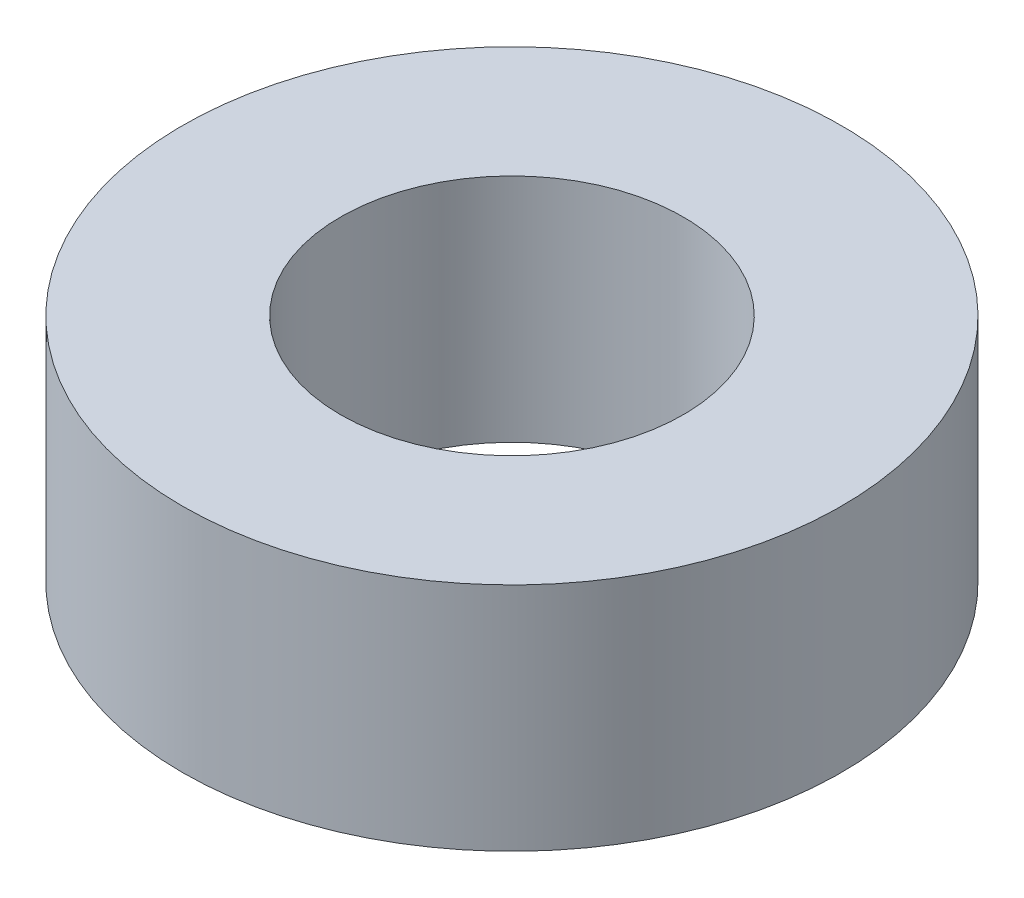
ISO-10303-21;
HEADER;
FILE_DESCRIPTION(('STEP AP214'),'2;1');
FILE_NAME('part.step','',(''),(''),'','','');
FILE_SCHEMA(('AUTOMOTIVE_DESIGN { 1 0 10303 214 1 1 1 1 }'));
ENDSEC;
DATA;
#1=APPLICATION_CONTEXT('core data for automotive mechanical design processes');
#2=APPLICATION_PROTOCOL_DEFINITION('international standard','automotive_design',2000,#1);
#3=PRODUCT_CONTEXT('',#1,'mechanical');
#4=PRODUCT('Part','Part','',(#3));
#5=PRODUCT_RELATED_PRODUCT_CATEGORY('part','',(#4));
#6=PRODUCT_DEFINITION_FORMATION('','',#4);
#7=PRODUCT_DEFINITION_CONTEXT('part definition',#1,'design');
#8=PRODUCT_DEFINITION('design','',#6,#7);
#9=PRODUCT_DEFINITION_SHAPE('','',#8);
#10=(LENGTH_UNIT() NAMED_UNIT(*) SI_UNIT(.MILLI.,.METRE.));
#11=(NAMED_UNIT(*) PLANE_ANGLE_UNIT() SI_UNIT($,.RADIAN.));
#12=(NAMED_UNIT(*) SI_UNIT($,.STERADIAN.) SOLID_ANGLE_UNIT());
#13=UNCERTAINTY_MEASURE_WITH_UNIT(LENGTH_MEASURE(1.E-05),#10,'distance_accuracy_value','');
#14=(GEOMETRIC_REPRESENTATION_CONTEXT(3) GLOBAL_UNCERTAINTY_ASSIGNED_CONTEXT((#13)) GLOBAL_UNIT_ASSIGNED_CONTEXT((#10,
#11,#12)) REPRESENTATION_CONTEXT('',''));
#15=CARTESIAN_POINT('',(0.,0.,0.));
#16=DIRECTION('',(0.,0.,1.));
#17=DIRECTION('',(1.,0.,0.));
#18=AXIS2_PLACEMENT_3D('',#15,#16,#17);
#19=CARTESIAN_POINT('',(0.,3.5,0.));
#20=DIRECTION('',(0.,1.,0.));
#21=DIRECTION('',(0.,0.,1.));
#22=AXIS2_PLACEMENT_3D('',#19,#20,#21);
#23=PLANE('',#22);
#24=CARTESIAN_POINT('',(0.,3.5,0.));
#25=DIRECTION('',(0.,1.,0.));
#26=DIRECTION('',(0.,0.,1.));
#27=AXIS2_PLACEMENT_3D('',#24,#25,#26);
#28=CIRCLE('',#27,5.);
#29=CARTESIAN_POINT('',(0.,3.5,5.));
#30=VERTEX_POINT('',#29);
#31=EDGE_CURVE('E10',#30,#30,#28,.T.);
#32=ORIENTED_EDGE('',*,*,#31,.T.);
#33=EDGE_LOOP('',(#32));
#34=FACE_BOUND('',#33,.T.);
#35=CARTESIAN_POINT('',(0.,3.5,0.));
#36=DIRECTION('',(0.,1.,0.));
#37=DIRECTION('',(0.,0.,1.));
#38=AXIS2_PLACEMENT_3D('',#35,#36,#37);
#39=CIRCLE('',#38,2.6);
#40=CARTESIAN_POINT('',(0.,3.5,2.6));
#41=VERTEX_POINT('',#40);
#42=EDGE_CURVE('E45',#41,#41,#39,.T.);
#43=ORIENTED_EDGE('',*,*,#42,.F.);
#44=EDGE_LOOP('',(#43));
#45=FACE_BOUND('',#44,.T.);
#46=ADVANCED_FACE('F34',(#34,#45),#23,.T.);
#47=CARTESIAN_POINT('',(0.,0.,0.));
#48=DIRECTION('',(0.,1.,0.));
#49=DIRECTION('',(0.,0.,1.));
#50=AXIS2_PLACEMENT_3D('',#47,#48,#49);
#51=PLANE('',#50);
#52=CARTESIAN_POINT('',(0.,0.,0.));
#53=DIRECTION('',(0.,1.,0.));
#54=DIRECTION('',(0.,0.,1.));
#55=AXIS2_PLACEMENT_3D('',#52,#53,#54);
#56=CIRCLE('',#55,5.);
#57=CARTESIAN_POINT('',(0.,0.,5.));
#58=VERTEX_POINT('',#57);
#59=EDGE_CURVE('E38',#58,#58,#56,.T.);
#60=ORIENTED_EDGE('',*,*,#59,.F.);
#61=EDGE_LOOP('',(#60));
#62=FACE_BOUND('',#61,.T.);
#63=CARTESIAN_POINT('',(0.,0.,0.));
#64=DIRECTION('',(0.,1.,0.));
#65=DIRECTION('',(0.,0.,1.));
#66=AXIS2_PLACEMENT_3D('',#63,#64,#65);
#67=CIRCLE('',#66,2.6);
#68=CARTESIAN_POINT('',(0.,0.,2.6));
#69=VERTEX_POINT('',#68);
#70=EDGE_CURVE('E47',#69,#69,#67,.T.);
#71=ORIENTED_EDGE('',*,*,#70,.T.);
#72=EDGE_LOOP('',(#71));
#73=FACE_BOUND('',#72,.T.);
#74=ADVANCED_FACE('F57',(#62,#73),#51,.F.);
#75=CARTESIAN_POINT('',(0.,3.5,0.));
#76=DIRECTION('',(0.,-1.,0.));
#77=DIRECTION('',(0.,0.,-1.));
#78=AXIS2_PLACEMENT_3D('',#75,#76,#77);
#79=CYLINDRICAL_SURFACE('',#78,5.);
#80=ORIENTED_EDGE('',*,*,#31,.F.);
#81=EDGE_LOOP('',(#80));
#82=FACE_BOUND('',#81,.T.);
#83=ORIENTED_EDGE('',*,*,#59,.T.);
#84=EDGE_LOOP('',(#83));
#85=FACE_BOUND('',#84,.T.);
#86=ADVANCED_FACE('F36',(#82,#85),#79,.T.);
#87=CARTESIAN_POINT('',(0.,3.5,0.));
#88=DIRECTION('',(0.,-1.,0.));
#89=DIRECTION('',(0.,0.,-1.));
#90=AXIS2_PLACEMENT_3D('',#87,#88,#89);
#91=CYLINDRICAL_SURFACE('',#90,2.6);
#92=ORIENTED_EDGE('',*,*,#42,.T.);
#93=EDGE_LOOP('',(#92));
#94=FACE_BOUND('',#93,.T.);
#95=ORIENTED_EDGE('',*,*,#70,.F.);
#96=EDGE_LOOP('',(#95));
#97=FACE_BOUND('',#96,.T.);
#98=ADVANCED_FACE('F53',(#94,#97),#91,.F.);
#99=CLOSED_SHELL('',(#46,#74,#86,#98));
#100=MANIFOLD_SOLID_BREP('B2',#99);
#101=ADVANCED_BREP_SHAPE_REPRESENTATION('',(#18,#100),#14);
#102=SHAPE_DEFINITION_REPRESENTATION(#9,#101);
ENDSEC;
END-ISO-10303-21;
